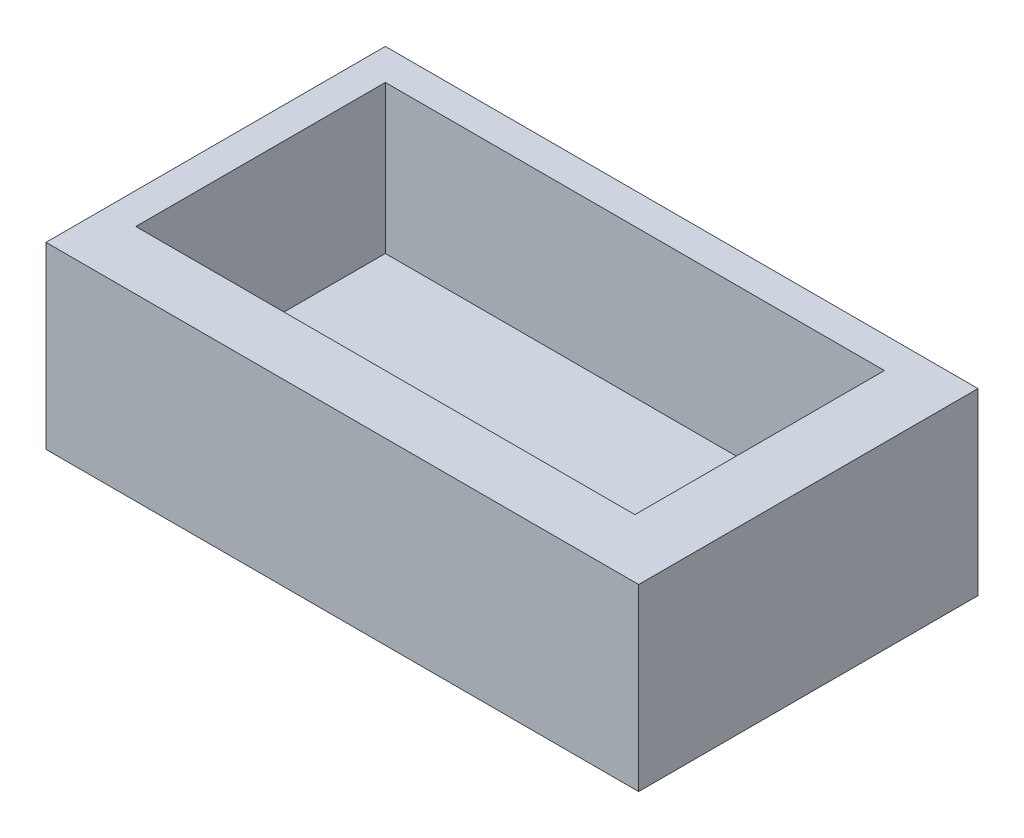
ISO-10303-21;
HEADER;
FILE_DESCRIPTION(('STEP AP214'),'2;1');
FILE_NAME('part.step','',(''),(''),'','','');
FILE_SCHEMA(('AUTOMOTIVE_DESIGN { 1 0 10303 214 1 1 1 1 }'));
ENDSEC;
DATA;
#1=APPLICATION_CONTEXT('core data for automotive mechanical design processes');
#2=APPLICATION_PROTOCOL_DEFINITION('international standard','automotive_design',2000,#1);
#3=PRODUCT_CONTEXT('',#1,'mechanical');
#4=PRODUCT('Part','Part','',(#3));
#5=PRODUCT_RELATED_PRODUCT_CATEGORY('part','',(#4));
#6=PRODUCT_DEFINITION_FORMATION('','',#4);
#7=PRODUCT_DEFINITION_CONTEXT('part definition',#1,'design');
#8=PRODUCT_DEFINITION('design','',#6,#7);
#9=PRODUCT_DEFINITION_SHAPE('','',#8);
#10=(LENGTH_UNIT() NAMED_UNIT(*) SI_UNIT(.MILLI.,.METRE.));
#11=(NAMED_UNIT(*) PLANE_ANGLE_UNIT() SI_UNIT($,.RADIAN.));
#12=(NAMED_UNIT(*) SI_UNIT($,.STERADIAN.) SOLID_ANGLE_UNIT());
#13=UNCERTAINTY_MEASURE_WITH_UNIT(LENGTH_MEASURE(1.E-05),#10,'distance_accuracy_value','');
#14=(GEOMETRIC_REPRESENTATION_CONTEXT(3) GLOBAL_UNCERTAINTY_ASSIGNED_CONTEXT((#13)) GLOBAL_UNIT_ASSIGNED_CONTEXT((#10,
#11,#12)) REPRESENTATION_CONTEXT('',''));
#15=CARTESIAN_POINT('',(0.,0.,0.));
#16=DIRECTION('',(0.,0.,1.));
#17=DIRECTION('',(1.,0.,0.));
#18=AXIS2_PLACEMENT_3D('',#15,#16,#17);
#19=CARTESIAN_POINT('',(-3.,53.7887045579115,-17.));
#20=DIRECTION('',(-1.,0.,0.));
#21=DIRECTION('',(0.,0.,1.));
#22=AXIS2_PLACEMENT_3D('',#19,#20,#21);
#23=PLANE('',#22);
#24=DIRECTION('',(0.,-1.,0.));
#25=VECTOR('',#24,1.);
#26=CARTESIAN_POINT('',(-3.,53.7887045579115,4.75892108676485));
#27=LINE('',#26,#25);
#28=CARTESIAN_POINT('',(-3.,8.5,4.75892108676485));
#29=VERTEX_POINT('',#28);
#30=CARTESIAN_POINT('',(-3.,-3.,4.75892108676485));
#31=VERTEX_POINT('',#30);
#32=EDGE_CURVE('E154',#29,#31,#27,.T.);
#33=ORIENTED_EDGE('',*,*,#32,.F.);
#34=DIRECTION('',(0.,0.,-1.));
#35=VECTOR('',#34,1.);
#36=CARTESIAN_POINT('',(-3.,8.5,-17.));
#37=LINE('',#36,#35);
#38=CARTESIAN_POINT('',(-3.,8.5,-17.));
#39=VERTEX_POINT('',#38);
#40=EDGE_CURVE('E127',#29,#39,#37,.T.);
#41=ORIENTED_EDGE('',*,*,#40,.T.);
#42=DIRECTION('',(0.,-1.,0.));
#43=VECTOR('',#42,1.);
#44=CARTESIAN_POINT('',(-3.,53.7887045579115,-17.));
#45=LINE('',#44,#43);
#46=CARTESIAN_POINT('',(-3.,-3.,-17.));
#47=VERTEX_POINT('',#46);
#48=EDGE_CURVE('E150',#39,#47,#45,.T.);
#49=ORIENTED_EDGE('',*,*,#48,.T.);
#50=DIRECTION('',(0.,0.,1.));
#51=VECTOR('',#50,1.);
#52=CARTESIAN_POINT('',(-3.,-3.,-17.));
#53=LINE('',#52,#51);
#54=EDGE_CURVE('E122',#47,#31,#53,.T.);
#55=ORIENTED_EDGE('',*,*,#54,.T.);
#56=EDGE_LOOP('',(#33,#41,#49,#55));
#57=FACE_BOUND('',#56,.T.);
#58=ADVANCED_FACE('F37',(#57),#23,.T.);
#59=CARTESIAN_POINT('',(-3.,53.7887045579115,4.75892108676485));
#60=DIRECTION('',(0.,0.,1.));
#61=DIRECTION('',(1.,0.,0.));
#62=AXIS2_PLACEMENT_3D('',#59,#60,#61);
#63=PLANE('',#62);
#64=DIRECTION('',(0.,-1.,0.));
#65=VECTOR('',#64,1.);
#66=CARTESIAN_POINT('',(35.,53.7887045579115,4.75892108676485));
#67=LINE('',#66,#65);
#68=CARTESIAN_POINT('',(35.,8.5,4.75892108676485));
#69=VERTEX_POINT('',#68);
#70=CARTESIAN_POINT('',(35.,-3.,4.75892108676485));
#71=VERTEX_POINT('',#70);
#72=EDGE_CURVE('E114',#69,#71,#67,.T.);
#73=ORIENTED_EDGE('',*,*,#72,.F.);
#74=DIRECTION('',(-1.,0.,0.));
#75=VECTOR('',#74,1.);
#76=CARTESIAN_POINT('',(-3.,8.5,4.75892108676485));
#77=LINE('',#76,#75);
#78=EDGE_CURVE('E151',#69,#29,#77,.T.);
#79=ORIENTED_EDGE('',*,*,#78,.T.);
#80=ORIENTED_EDGE('',*,*,#32,.T.);
#81=DIRECTION('',(1.,0.,0.));
#82=VECTOR('',#81,1.);
#83=CARTESIAN_POINT('',(-3.,-3.,4.75892108676485));
#84=LINE('',#83,#82);
#85=EDGE_CURVE('E118',#31,#71,#84,.T.);
#86=ORIENTED_EDGE('',*,*,#85,.T.);
#87=EDGE_LOOP('',(#73,#79,#80,#86));
#88=FACE_BOUND('',#87,.T.);
#89=ADVANCED_FACE('F191',(#88),#63,.T.);
#90=CARTESIAN_POINT('',(35.,53.7887045579115,-17.));
#91=DIRECTION('',(1.,0.,0.));
#92=DIRECTION('',(0.,0.,-1.));
#93=AXIS2_PLACEMENT_3D('',#90,#91,#92);
#94=PLANE('',#93);
#95=DIRECTION('',(0.,-1.,0.));
#96=VECTOR('',#95,1.);
#97=CARTESIAN_POINT('',(35.,53.7887045579115,-17.));
#98=LINE('',#97,#96);
#99=CARTESIAN_POINT('',(35.,8.5,-17.));
#100=VERTEX_POINT('',#99);
#101=CARTESIAN_POINT('',(35.,-3.,-17.));
#102=VERTEX_POINT('',#101);
#103=EDGE_CURVE('E99',#100,#102,#98,.T.);
#104=ORIENTED_EDGE('',*,*,#103,.F.);
#105=DIRECTION('',(0.,0.,1.));
#106=VECTOR('',#105,1.);
#107=CARTESIAN_POINT('',(35.,8.5,-17.));
#108=LINE('',#107,#106);
#109=EDGE_CURVE('E155',#100,#69,#108,.T.);
#110=ORIENTED_EDGE('',*,*,#109,.T.);
#111=ORIENTED_EDGE('',*,*,#72,.T.);
#112=DIRECTION('',(0.,0.,1.));
#113=VECTOR('',#112,1.);
#114=CARTESIAN_POINT('',(35.,-3.,-17.));
#115=LINE('',#114,#113);
#116=EDGE_CURVE('E111',#102,#71,#115,.T.);
#117=ORIENTED_EDGE('',*,*,#116,.F.);
#118=EDGE_LOOP('',(#104,#110,#111,#117));
#119=FACE_BOUND('',#118,.T.);
#120=ADVANCED_FACE('F112',(#119),#94,.T.);
#121=CARTESIAN_POINT('',(-3.,53.7887045579115,-17.));
#122=DIRECTION('',(0.,0.,-1.));
#123=DIRECTION('',(-1.,0.,0.));
#124=AXIS2_PLACEMENT_3D('',#121,#122,#123);
#125=PLANE('',#124);
#126=ORIENTED_EDGE('',*,*,#48,.F.);
#127=DIRECTION('',(1.,0.,0.));
#128=VECTOR('',#127,1.);
#129=CARTESIAN_POINT('',(-3.,8.5,-17.));
#130=LINE('',#129,#128);
#131=EDGE_CURVE('E55',#39,#100,#130,.T.);
#132=ORIENTED_EDGE('',*,*,#131,.T.);
#133=ORIENTED_EDGE('',*,*,#103,.T.);
#134=DIRECTION('',(1.,0.,0.));
#135=VECTOR('',#134,1.);
#136=CARTESIAN_POINT('',(-3.,-3.,-17.));
#137=LINE('',#136,#135);
#138=EDGE_CURVE('E104',#47,#102,#137,.T.);
#139=ORIENTED_EDGE('',*,*,#138,.F.);
#140=EDGE_LOOP('',(#126,#132,#133,#139));
#141=FACE_BOUND('',#140,.T.);
#142=ADVANCED_FACE('F102',(#141),#125,.T.);
#143=CARTESIAN_POINT('',(-1.,53.7887045579115,-15.));
#144=DIRECTION('',(0.,0.,-1.));
#145=DIRECTION('',(-1.,0.,0.));
#146=AXIS2_PLACEMENT_3D('',#143,#144,#145);
#147=PLANE('',#146);
#148=DIRECTION('',(1.,0.,0.));
#149=VECTOR('',#148,1.);
#150=CARTESIAN_POINT('',(-1.,8.5,-15.));
#151=LINE('',#150,#149);
#152=CARTESIAN_POINT('',(-1.,8.5,-15.));
#153=VERTEX_POINT('',#152);
#154=CARTESIAN_POINT('',(31.,8.5,-15.));
#155=VERTEX_POINT('',#154);
#156=EDGE_CURVE('E144',#153,#155,#151,.T.);
#157=ORIENTED_EDGE('',*,*,#156,.F.);
#158=DIRECTION('',(0.,-1.,0.));
#159=VECTOR('',#158,1.);
#160=CARTESIAN_POINT('',(-1.,53.7887045579115,-15.));
#161=LINE('',#160,#159);
#162=CARTESIAN_POINT('',(-1.,-1.,-15.));
#163=VERTEX_POINT('',#162);
#164=EDGE_CURVE('E108',#153,#163,#161,.T.);
#165=ORIENTED_EDGE('',*,*,#164,.T.);
#166=DIRECTION('',(1.,0.,0.));
#167=VECTOR('',#166,1.);
#168=CARTESIAN_POINT('',(-1.,-1.,-15.));
#169=LINE('',#168,#167);
#170=CARTESIAN_POINT('',(31.,-1.,-15.));
#171=VERTEX_POINT('',#170);
#172=EDGE_CURVE('E140',#163,#171,#169,.T.);
#173=ORIENTED_EDGE('',*,*,#172,.T.);
#174=DIRECTION('',(0.,-1.,0.));
#175=VECTOR('',#174,1.);
#176=CARTESIAN_POINT('',(31.,53.7887045579115,-15.));
#177=LINE('',#176,#175);
#178=EDGE_CURVE('E41',#155,#171,#177,.T.);
#179=ORIENTED_EDGE('',*,*,#178,.F.);
#180=EDGE_LOOP('',(#157,#165,#173,#179));
#181=FACE_BOUND('',#180,.T.);
#182=ADVANCED_FACE('F182',(#181),#147,.F.);
#183=CARTESIAN_POINT('',(-1.,53.7887045579115,-15.));
#184=DIRECTION('',(-1.,0.,0.));
#185=DIRECTION('',(0.,0.,1.));
#186=AXIS2_PLACEMENT_3D('',#183,#184,#185);
#187=PLANE('',#186);
#188=DIRECTION('',(0.,0.,-1.));
#189=VECTOR('',#188,1.);
#190=CARTESIAN_POINT('',(-1.,8.5,-15.));
#191=LINE('',#190,#189);
#192=CARTESIAN_POINT('',(-1.,8.5,1.));
#193=VERTEX_POINT('',#192);
#194=EDGE_CURVE('E139',#193,#153,#191,.T.);
#195=ORIENTED_EDGE('',*,*,#194,.F.);
#196=DIRECTION('',(0.,-1.,0.));
#197=VECTOR('',#196,1.);
#198=CARTESIAN_POINT('',(-1.,53.7887045579115,1.));
#199=LINE('',#198,#197);
#200=CARTESIAN_POINT('',(-1.,-1.,1.));
#201=VERTEX_POINT('',#200);
#202=EDGE_CURVE('E132',#193,#201,#199,.T.);
#203=ORIENTED_EDGE('',*,*,#202,.T.);
#204=DIRECTION('',(0.,0.,-1.));
#205=VECTOR('',#204,1.);
#206=CARTESIAN_POINT('',(-1.,-1.,-15.));
#207=LINE('',#206,#205);
#208=EDGE_CURVE('E128',#201,#163,#207,.T.);
#209=ORIENTED_EDGE('',*,*,#208,.T.);
#210=ORIENTED_EDGE('',*,*,#164,.F.);
#211=EDGE_LOOP('',(#195,#203,#209,#210));
#212=FACE_BOUND('',#211,.T.);
#213=ADVANCED_FACE('F179',(#212),#187,.F.);
#214=CARTESIAN_POINT('',(-1.,53.7887045579115,1.));
#215=DIRECTION('',(0.,0.,1.));
#216=DIRECTION('',(1.,0.,0.));
#217=AXIS2_PLACEMENT_3D('',#214,#215,#216);
#218=PLANE('',#217);
#219=DIRECTION('',(-1.,0.,0.));
#220=VECTOR('',#219,1.);
#221=CARTESIAN_POINT('',(-1.,8.5,1.));
#222=LINE('',#221,#220);
#223=CARTESIAN_POINT('',(31.,8.5,1.));
#224=VERTEX_POINT('',#223);
#225=EDGE_CURVE('E11',#224,#193,#222,.T.);
#226=ORIENTED_EDGE('',*,*,#225,.F.);
#227=DIRECTION('',(0.,-1.,0.));
#228=VECTOR('',#227,1.);
#229=CARTESIAN_POINT('',(31.,53.7887045579115,1.));
#230=LINE('',#229,#228);
#231=CARTESIAN_POINT('',(31.,-1.,1.));
#232=VERTEX_POINT('',#231);
#233=EDGE_CURVE('E131',#224,#232,#230,.T.);
#234=ORIENTED_EDGE('',*,*,#233,.T.);
#235=DIRECTION('',(-1.,0.,0.));
#236=VECTOR('',#235,1.);
#237=CARTESIAN_POINT('',(-1.,-1.,1.));
#238=LINE('',#237,#236);
#239=EDGE_CURVE('E133',#232,#201,#238,.T.);
#240=ORIENTED_EDGE('',*,*,#239,.T.);
#241=ORIENTED_EDGE('',*,*,#202,.F.);
#242=EDGE_LOOP('',(#226,#234,#240,#241));
#243=FACE_BOUND('',#242,.T.);
#244=ADVANCED_FACE('F169',(#243),#218,.F.);
#245=CARTESIAN_POINT('',(31.,53.7887045579115,-15.));
#246=DIRECTION('',(1.,0.,0.));
#247=DIRECTION('',(0.,0.,-1.));
#248=AXIS2_PLACEMENT_3D('',#245,#246,#247);
#249=PLANE('',#248);
#250=DIRECTION('',(0.,0.,1.));
#251=VECTOR('',#250,1.);
#252=CARTESIAN_POINT('',(31.,8.5,-15.));
#253=LINE('',#252,#251);
#254=EDGE_CURVE('E47',#155,#224,#253,.T.);
#255=ORIENTED_EDGE('',*,*,#254,.F.);
#256=ORIENTED_EDGE('',*,*,#178,.T.);
#257=DIRECTION('',(0.,0.,1.));
#258=VECTOR('',#257,1.);
#259=CARTESIAN_POINT('',(31.,-1.,-15.));
#260=LINE('',#259,#258);
#261=EDGE_CURVE('E136',#171,#232,#260,.T.);
#262=ORIENTED_EDGE('',*,*,#261,.T.);
#263=ORIENTED_EDGE('',*,*,#233,.F.);
#264=EDGE_LOOP('',(#255,#256,#262,#263));
#265=FACE_BOUND('',#264,.T.);
#266=ADVANCED_FACE('F174',(#265),#249,.F.);
#267=CARTESIAN_POINT('',(48.414936687625,8.5,-30.6224474549228));
#268=DIRECTION('',(0.,1.,0.));
#269=DIRECTION('',(0.,0.,1.));
#270=AXIS2_PLACEMENT_3D('',#267,#268,#269);
#271=PLANE('',#270);
#272=ORIENTED_EDGE('',*,*,#40,.F.);
#273=ORIENTED_EDGE('',*,*,#78,.F.);
#274=ORIENTED_EDGE('',*,*,#109,.F.);
#275=ORIENTED_EDGE('',*,*,#131,.F.);
#276=EDGE_LOOP('',(#272,#273,#274,#275));
#277=FACE_BOUND('',#276,.T.);
#278=ORIENTED_EDGE('',*,*,#194,.T.);
#279=ORIENTED_EDGE('',*,*,#156,.T.);
#280=ORIENTED_EDGE('',*,*,#254,.T.);
#281=ORIENTED_EDGE('',*,*,#225,.T.);
#282=EDGE_LOOP('',(#278,#279,#280,#281));
#283=FACE_BOUND('',#282,.T.);
#284=ADVANCED_FACE('F39',(#277,#283),#271,.T.);
#285=CARTESIAN_POINT('',(0.,-3.,0.));
#286=DIRECTION('',(0.,-1.,0.));
#287=DIRECTION('',(0.,0.,-1.));
#288=AXIS2_PLACEMENT_3D('',#285,#286,#287);
#289=PLANE('',#288);
#290=ORIENTED_EDGE('',*,*,#138,.T.);
#291=ORIENTED_EDGE('',*,*,#116,.T.);
#292=ORIENTED_EDGE('',*,*,#85,.F.);
#293=ORIENTED_EDGE('',*,*,#54,.F.);
#294=EDGE_LOOP('',(#290,#291,#292,#293));
#295=FACE_BOUND('',#294,.T.);
#296=ADVANCED_FACE('F120',(#295),#289,.T.);
#297=CARTESIAN_POINT('',(0.,-1.,0.));
#298=DIRECTION('',(0.,-1.,0.));
#299=DIRECTION('',(0.,0.,-1.));
#300=AXIS2_PLACEMENT_3D('',#297,#298,#299);
#301=PLANE('',#300);
#302=ORIENTED_EDGE('',*,*,#261,.F.);
#303=ORIENTED_EDGE('',*,*,#172,.F.);
#304=ORIENTED_EDGE('',*,*,#208,.F.);
#305=ORIENTED_EDGE('',*,*,#239,.F.);
#306=EDGE_LOOP('',(#302,#303,#304,#305));
#307=FACE_BOUND('',#306,.T.);
#308=ADVANCED_FACE('F176',(#307),#301,.F.);
#309=CLOSED_SHELL('',(#58,#89,#120,#142,#182,#213,#244,#266,#284,#296,#308));
#310=MANIFOLD_SOLID_BREP('B2',#309);
#311=ADVANCED_BREP_SHAPE_REPRESENTATION('',(#18,#310),#14);
#312=SHAPE_DEFINITION_REPRESENTATION(#9,#311);
ENDSEC;
END-ISO-10303-21;
